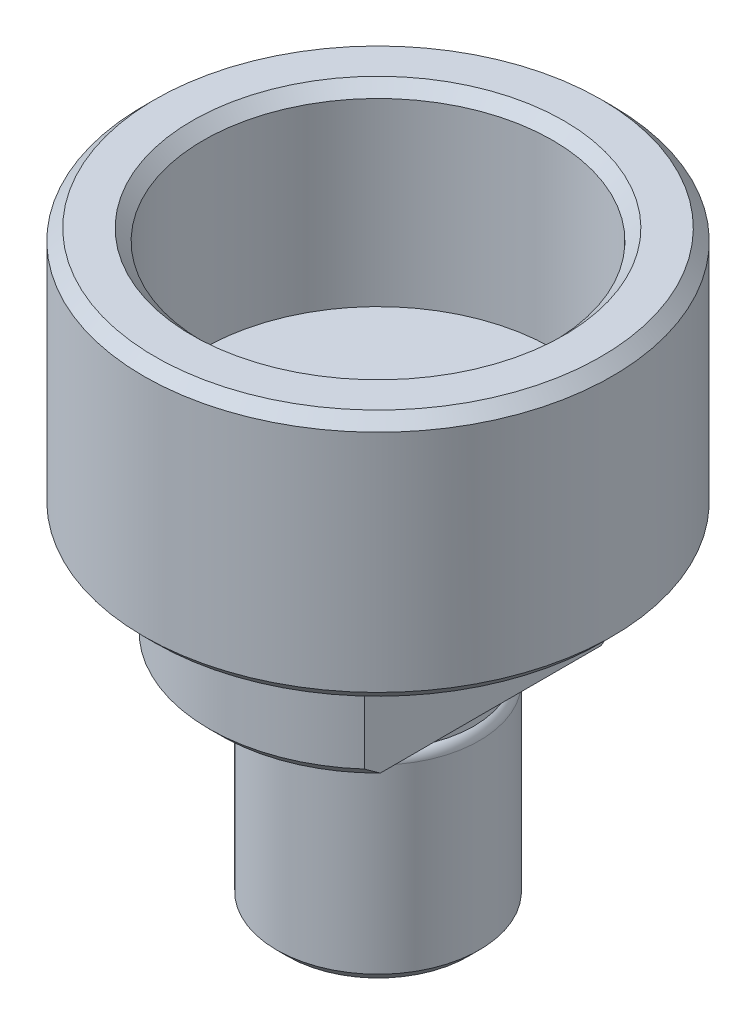
ISO-10303-21;
HEADER;
FILE_DESCRIPTION(('STEP AP214'),'2;1');
FILE_NAME('part.step','',(''),(''),'','','');
FILE_SCHEMA(('AUTOMOTIVE_DESIGN { 1 0 10303 214 1 1 1 1 }'));
ENDSEC;
DATA;
#1=APPLICATION_CONTEXT('core data for automotive mechanical design processes');
#2=APPLICATION_PROTOCOL_DEFINITION('international standard','automotive_design',2000,#1);
#3=PRODUCT_CONTEXT('',#1,'mechanical');
#4=PRODUCT('Part','Part','',(#3));
#5=PRODUCT_RELATED_PRODUCT_CATEGORY('part','',(#4));
#6=PRODUCT_DEFINITION_FORMATION('','',#4);
#7=PRODUCT_DEFINITION_CONTEXT('part definition',#1,'design');
#8=PRODUCT_DEFINITION('design','',#6,#7);
#9=PRODUCT_DEFINITION_SHAPE('','',#8);
#10=(LENGTH_UNIT() NAMED_UNIT(*) SI_UNIT(.MILLI.,.METRE.));
#11=(NAMED_UNIT(*) PLANE_ANGLE_UNIT() SI_UNIT($,.RADIAN.));
#12=(NAMED_UNIT(*) SI_UNIT($,.STERADIAN.) SOLID_ANGLE_UNIT());
#13=UNCERTAINTY_MEASURE_WITH_UNIT(LENGTH_MEASURE(1.E-05),#10,'distance_accuracy_value','');
#14=(GEOMETRIC_REPRESENTATION_CONTEXT(3) GLOBAL_UNCERTAINTY_ASSIGNED_CONTEXT((#13)) GLOBAL_UNIT_ASSIGNED_CONTEXT((#10,
#11,#12)) REPRESENTATION_CONTEXT('',''));
#15=CARTESIAN_POINT('',(0.,0.,0.));
#16=DIRECTION('',(0.,0.,1.));
#17=DIRECTION('',(1.,0.,0.));
#18=AXIS2_PLACEMENT_3D('',#15,#16,#17);
#19=CARTESIAN_POINT('',(0.,50.3749900838748,0.));
#20=DIRECTION('',(0.,1.,0.));
#21=DIRECTION('',(0.,0.,1.));
#22=AXIS2_PLACEMENT_3D('',#19,#20,#21);
#23=CYLINDRICAL_SURFACE('',#22,15.);
#24=CARTESIAN_POINT('',(0.,21.,0.));
#25=DIRECTION('',(0.,1.,0.));
#26=DIRECTION('',(0.,0.,1.));
#27=AXIS2_PLACEMENT_3D('',#24,#25,#26);
#28=CIRCLE('',#27,15.);
#29=CARTESIAN_POINT('',(10.,21.,-11.1803398874989));
#30=VERTEX_POINT('',#29);
#31=CARTESIAN_POINT('',(-10.,21.,-11.180339887499));
#32=VERTEX_POINT('',#31);
#33=EDGE_CURVE('E147',#30,#32,#28,.T.);
#34=ORIENTED_EDGE('',*,*,#33,.T.);
#35=DIRECTION('',(0.,-1.,0.));
#36=VECTOR('',#35,1.);
#37=CARTESIAN_POINT('',(-10.,56.8303043016158,-11.180339887499));
#38=LINE('',#37,#36);
#39=CARTESIAN_POINT('',(-10.,30.,-11.180339887499));
#40=VERTEX_POINT('',#39);
#41=EDGE_CURVE('E106',#40,#32,#38,.T.);
#42=ORIENTED_EDGE('',*,*,#41,.F.);
#43=CARTESIAN_POINT('',(0.,30.,0.));
#44=DIRECTION('',(0.,1.,0.));
#45=DIRECTION('',(0.,0.,1.));
#46=AXIS2_PLACEMENT_3D('',#43,#44,#45);
#47=CIRCLE('',#46,15.);
#48=CARTESIAN_POINT('',(10.,30.,-11.1803398874989));
#49=VERTEX_POINT('',#48);
#50=EDGE_CURVE('E105',#49,#40,#47,.T.);
#51=ORIENTED_EDGE('',*,*,#50,.F.);
#52=DIRECTION('',(0.,-1.,0.));
#53=VECTOR('',#52,1.);
#54=CARTESIAN_POINT('',(10.,56.8303043016158,-11.1803398874989));
#55=LINE('',#54,#53);
#56=EDGE_CURVE('E249',#49,#30,#55,.T.);
#57=ORIENTED_EDGE('',*,*,#56,.T.);
#58=EDGE_LOOP('',(#34,#42,#51,#57));
#59=FACE_BOUND('',#58,.T.);
#60=ADVANCED_FACE('F33',(#59),#23,.T.);
#61=CARTESIAN_POINT('',(0.,21.,0.));
#62=DIRECTION('',(0.,1.,0.));
#63=DIRECTION('',(0.,0.,1.));
#64=AXIS2_PLACEMENT_3D('',#61,#62,#63);
#65=CONICAL_SURFACE('',#64,15.,0.78539816339745);
#66=CARTESIAN_POINT('',(-10.,32.5644441736091,-24.6103574588586));
#67=CARTESIAN_POINT('',(-10.,32.2216905274031,-24.2403780110369));
#68=CARTESIAN_POINT('',(-10.,31.8795152361576,-23.8698614563677));
#69=CARTESIAN_POINT('',(-10.,31.196508334364,-23.1275872380002));
#70=CARTESIAN_POINT('',(-10.,30.8556767334816,-22.7558295654095));
#71=CARTESIAN_POINT('',(-10.,30.1754748234069,-22.0108301601288));
#72=CARTESIAN_POINT('',(-10.,29.8361048497004,-21.6375881209847));
#73=CARTESIAN_POINT('',(-10.,29.1591402559152,-20.8894981010583));
#74=CARTESIAN_POINT('',(-10.,28.8215456324339,-20.5146501233564));
#75=CARTESIAN_POINT('',(-10.,28.1464075059443,-19.7608611770608));
#76=CARTESIAN_POINT('',(-10.,27.8088763594913,-19.3819091350376));
#77=CARTESIAN_POINT('',(-10.,27.1362616375537,-18.621839069388));
#78=CARTESIAN_POINT('',(-10.,26.8011780566562,-18.2407210505552));
#79=CARTESIAN_POINT('',(-10.,26.1339423824658,-17.4759989187297));
#80=CARTESIAN_POINT('',(-10.,25.8017899728563,-17.0923950819376));
#81=CARTESIAN_POINT('',(-10.,25.1409431225824,-16.3222193994949));
#82=CARTESIAN_POINT('',(-10.,24.8122486659603,-15.9356475675552));
#83=CARTESIAN_POINT('',(-10.,24.2245317757005,-15.2368546277592));
#84=CARTESIAN_POINT('',(-10.,23.9647550380599,-14.9252682200788));
#85=CARTESIAN_POINT('',(-10.,23.4483413376404,-14.2995054302808));
#86=CARTESIAN_POINT('',(-10.,23.1917043502325,-13.985329068512));
#87=CARTESIAN_POINT('',(-10.,22.6820772637162,-13.3538933206977));
#88=CARTESIAN_POINT('',(-10.,22.4290881319471,-13.0366331529145));
#89=CARTESIAN_POINT('',(-10.,21.9275509493998,-12.3986197972893));
#90=CARTESIAN_POINT('',(-10.,21.6790028656167,-12.0778666354352));
#91=CARTESIAN_POINT('',(-10.,21.1875502500527,-11.4326438070171));
#92=CARTESIAN_POINT('',(-10.,20.9446395182488,-11.108178872598));
#93=CARTESIAN_POINT('',(-10.,20.4653334597884,-10.4544394881493));
#94=CARTESIAN_POINT('',(-10.,20.2289383898083,-10.1251648494271));
#95=CARTESIAN_POINT('',(-10.,19.7643059741728,-9.46109895998293));
#96=CARTESIAN_POINT('',(-10.,19.5360652053658,-9.12631011243504));
#97=CARTESIAN_POINT('',(-10.,19.0896742449105,-8.45009456194251));
#98=CARTESIAN_POINT('',(-10.,18.871522919324,-8.10866861108843));
#99=CARTESIAN_POINT('',(-10.,18.4541163076828,-7.42799976889248));
#100=CARTESIAN_POINT('',(-10.,18.2544960922178,-7.08898186795268));
#101=CARTESIAN_POINT('',(-10.,17.8704893467786,-6.40230874634735));
#102=CARTESIAN_POINT('',(-10.,17.6861045208227,-6.05465256516516));
#103=CARTESIAN_POINT('',(-10.,17.3369597792457,-5.34979787272712));
#104=CARTESIAN_POINT('',(-10.,17.1721879695829,-4.99260530726622));
#105=CARTESIAN_POINT('',(-10.,16.8676108195506,-4.26767172679641));
#106=CARTESIAN_POINT('',(-10.,16.727798461058,-3.89993371082866));
#107=CARTESIAN_POINT('',(-10.,16.50682763487,-3.23556268816039));
#108=CARTESIAN_POINT('',(-10.,16.4195291881363,-2.94098364490695));
#109=CARTESIAN_POINT('',(-10.,16.2674806467661,-2.34601701033665));
#110=CARTESIAN_POINT('',(-10.,16.2027277474496,-2.04563014642715));
#111=CARTESIAN_POINT('',(-10.,16.0989802914043,-1.44139591299687));
#112=CARTESIAN_POINT('',(-10.,16.0599015641133,-1.13756320711696));
#113=CARTESIAN_POINT('',(-10.,16.009297169542,-0.527590785366104));
#114=CARTESIAN_POINT('',(-10.,15.9977699006607,-0.221451204634574));
#115=CARTESIAN_POINT('',(-10.,16.0029524746225,0.391440262624027));
#116=CARTESIAN_POINT('',(-10.,16.0197412333657,0.698191472734164));
#117=CARTESIAN_POINT('',(-10.,16.0807204713956,1.30893601590609));
#118=CARTESIAN_POINT('',(-10.,16.1249131175112,1.61292912895606));
#119=CARTESIAN_POINT('',(-10.,16.2385095552279,2.21708187284227));
#120=CARTESIAN_POINT('',(-10.,16.3079917081605,2.51722655350808));
#121=CARTESIAN_POINT('',(-10.,16.4689760172869,3.11148447855054));
#122=CARTESIAN_POINT('',(-10.,16.5604791901926,3.40559744376187));
#123=CARTESIAN_POINT('',(-10.,16.7734548765495,4.01987818282988));
#124=CARTESIAN_POINT('',(-10.,16.8971364178112,4.33927357504705));
#125=CARTESIAN_POINT('',(-10.,17.1633649280956,4.97016892612008));
#126=CARTESIAN_POINT('',(-10.,17.3059198771215,5.28166547845749));
#127=CARTESIAN_POINT('',(-10.,17.6064808039564,5.89769520002045));
#128=CARTESIAN_POINT('',(-10.,17.7645119994124,6.2022159720844));
#129=CARTESIAN_POINT('',(-10.,18.0928538515898,6.80447097562444));
#130=CARTESIAN_POINT('',(-10.,18.263162952979,7.10220606042625));
#131=CARTESIAN_POINT('',(-10.,18.6159450346942,7.69542966012903));
#132=CARTESIAN_POINT('',(-10.,18.798543992619,7.9908429077063));
#133=CARTESIAN_POINT('',(-10.,19.1720554324511,8.5763546374259));
#134=CARTESIAN_POINT('',(-10.,19.3629681035662,8.86645299839561));
#135=CARTESIAN_POINT('',(-10.,19.7514253100881,9.44175091087438));
#136=CARTESIAN_POINT('',(-10.,19.9489632215143,9.72695494835962));
#137=CARTESIAN_POINT('',(-10.,20.3496766786508,10.2933602389833));
#138=CARTESIAN_POINT('',(-10.,20.5528521655921,10.5745615338023));
#139=CARTESIAN_POINT('',(-10.,20.9887612453635,11.1672748608417));
#140=CARTESIAN_POINT('',(-10.,21.2220989986398,11.4783418942238));
#141=CARTESIAN_POINT('',(-10.,21.6936712260345,12.096747683235));
#142=CARTESIAN_POINT('',(-10.,21.931905839655,12.404086332252));
#143=CARTESIAN_POINT('',(-10.,22.4124830849794,13.015581150023));
#144=CARTESIAN_POINT('',(-10.,22.6548261325384,13.3197369915134));
#145=CARTESIAN_POINT('',(-10.,23.1429613874972,13.9252706474696));
#146=CARTESIAN_POINT('',(-10.,23.3887536409655,14.2266484247415));
#147=CARTESIAN_POINT('',(-10.,24.1309416508131,15.1277078385904));
#148=CARTESIAN_POINT('',(-10.,24.6317229648929,15.7237777732566));
#149=CARTESIAN_POINT('',(-10.,25.6418999800074,16.9085714118714));
#150=CARTESIAN_POINT('',(-10.,26.1512959112258,17.4972949187898));
#151=CARTESIAN_POINT('',(-10.,26.9056587911493,18.3593115817367));
#152=CARTESIAN_POINT('',(-10.,27.1480720002065,18.6348451883551));
#153=CARTESIAN_POINT('',(-10.,27.6341954597043,19.1847583131501));
#154=CARTESIAN_POINT('',(-10.,27.8779056899267,19.4591378491978));
#155=CARTESIAN_POINT('',(-10.,28.6107786732563,20.2807468890151));
#156=CARTESIAN_POINT('',(-10.,29.1016718512256,20.8264332919545));
#157=CARTESIAN_POINT('',(-10.,30.0861834355478,21.9134039380248));
#158=CARTESIAN_POINT('',(-10.,30.5797946737353,22.4546946841883));
#159=CARTESIAN_POINT('',(-10.,31.5700218475962,23.5344790116023));
#160=CARTESIAN_POINT('',(-10.,32.0666376531121,24.0729727121686));
#161=CARTESIAN_POINT('',(-10.,32.5644441736091,24.6103574588586));
#162=B_SPLINE_CURVE_WITH_KNOTS('',3,(#66,#67,#68,#69,#70,#71,#72,#73,#74,#75,#76,#77,#78,#79,
#80,#81,#82,#83,#84,#85,#86,#87,#88,#89,#90,#91,#92,#93,#94,#95,#96,#97,#98,#99,#100,#101,#102,
#103,#104,#105,#106,#107,#108,#109,#110,#111,#112,#113,#114,#115,#116,#117,#118,#119,#120,#121,
#122,#123,#124,#125,#126,#127,#128,#129,#130,#131,#132,#133,#134,#135,#136,#137,#138,#139,#140,
#141,#142,#143,#144,#145,#146,#147,#148,#149,#150,#151,#152,#153,#154,#155,#156,#157,#158,#159,
#160,#161),.UNSPECIFIED.,.F.,.F.,(4,2,2,2,2,2,2,2,2,2,2,2,2,2,2,2,2,2,2,2,2,2,2,2,2,2,2,2,2,2,2,
2,2,2,2,2,2,2,2,2,2,2,2,2,2,2,2,4),(0.,1.51303871186474,3.02608828773642,4.53946839108167,
6.05284559291245,7.57526476841032,9.0976805760035,10.6199300324629,12.142172460924,
13.3591725240687,14.5761630345685,15.7934705419248,17.0107689987406,18.2266582841975,
19.4425953998349,20.6580159228905,21.8732995129504,23.0532599784362,24.2333522397084,
25.4127251644243,26.5917659477831,27.5127426411267,28.4336047234359,29.3514325707392,
30.2692070622632,31.1895435918779,32.1099529019026,33.0332387889305,33.9565673123118,
34.9833356839157,36.0105395857438,37.039446023785,38.0682223509588,39.1099287407537,
40.1516588506401,41.1923767800673,42.2330838645851,43.3995931312981,44.5661356757823,
45.7327970109922,46.8994739433089,49.2348850369403,51.5703586319431,52.6713304691807,
53.7722851941572,55.9742486399645,58.1719242629713,60.3695053551407),.UNSPECIFIED.);
#163=CARTESIAN_POINT('',(-10.,20.,-9.79795897113272));
#164=VERTEX_POINT('',#163);
#165=EDGE_CURVE('E11',#32,#164,#162,.T.);
#166=ORIENTED_EDGE('',*,*,#165,.F.);
#167=ORIENTED_EDGE('',*,*,#33,.F.);
#168=CARTESIAN_POINT('',(10.,32.5644441736091,24.6103574588586));
#169=CARTESIAN_POINT('',(10.,32.2216905274031,24.2403780110369));
#170=CARTESIAN_POINT('',(10.,31.8795152361576,23.8698614563677));
#171=CARTESIAN_POINT('',(10.,31.196508334364,23.1275872380002));
#172=CARTESIAN_POINT('',(10.,30.8556767334816,22.7558295654095));
#173=CARTESIAN_POINT('',(10.,30.1754748234069,22.0108301601288));
#174=CARTESIAN_POINT('',(10.,29.8361048497004,21.6375881209847));
#175=CARTESIAN_POINT('',(10.,29.1591402559152,20.8894981010583));
#176=CARTESIAN_POINT('',(10.,28.8215456324339,20.5146501233563));
#177=CARTESIAN_POINT('',(10.,28.1464075059443,19.7608611770608));
#178=CARTESIAN_POINT('',(10.,27.8088763594913,19.3819091350376));
#179=CARTESIAN_POINT('',(10.,27.1362616375537,18.621839069388));
#180=CARTESIAN_POINT('',(10.,26.8011780566562,18.2407210505552));
#181=CARTESIAN_POINT('',(10.,26.1339423824658,17.4759989187297));
#182=CARTESIAN_POINT('',(10.,25.8017899728563,17.0923950819376));
#183=CARTESIAN_POINT('',(10.,25.1409431225824,16.3222193994948));
#184=CARTESIAN_POINT('',(10.,24.8122486659603,15.9356475675552));
#185=CARTESIAN_POINT('',(10.,24.2245317757005,15.2368546277592));
#186=CARTESIAN_POINT('',(10.,23.9647550380599,14.9252682200788));
#187=CARTESIAN_POINT('',(10.,23.4483413376404,14.2995054302808));
#188=CARTESIAN_POINT('',(10.,23.1917043502325,13.985329068512));
#189=CARTESIAN_POINT('',(10.,22.6820772637162,13.3538933206977));
#190=CARTESIAN_POINT('',(10.,22.4290881319471,13.0366331529145));
#191=CARTESIAN_POINT('',(10.,21.9275509493998,12.3986197972893));
#192=CARTESIAN_POINT('',(10.,21.6790028656167,12.0778666354352));
#193=CARTESIAN_POINT('',(10.,21.1875502500527,11.432643807017));
#194=CARTESIAN_POINT('',(10.,20.9446395182488,11.108178872598));
#195=CARTESIAN_POINT('',(10.,20.4653334597884,10.4544394881493));
#196=CARTESIAN_POINT('',(10.,20.2289383898083,10.1251648494271));
#197=CARTESIAN_POINT('',(10.,19.7643059741728,9.46109895998293));
#198=CARTESIAN_POINT('',(10.,19.5360652053658,9.12631011243505));
#199=CARTESIAN_POINT('',(10.,19.0896742449105,8.45009456194252));
#200=CARTESIAN_POINT('',(10.,18.871522919324,8.10866861108844));
#201=CARTESIAN_POINT('',(10.,18.4541163076828,7.42799976889249));
#202=CARTESIAN_POINT('',(10.,18.2544960922178,7.08898186795269));
#203=CARTESIAN_POINT('',(10.,17.8704893467786,6.40230874634736));
#204=CARTESIAN_POINT('',(10.,17.6861045208227,6.05465256516517));
#205=CARTESIAN_POINT('',(10.,17.3369597792457,5.34979787272713));
#206=CARTESIAN_POINT('',(10.,17.1721879695829,4.99260530726623));
#207=CARTESIAN_POINT('',(10.,16.8676108195506,4.26767172679642));
#208=CARTESIAN_POINT('',(10.,16.727798461058,3.89993371082867));
#209=CARTESIAN_POINT('',(10.,16.50682763487,3.23556268816039));
#210=CARTESIAN_POINT('',(10.,16.4195291881363,2.94098364490695));
#211=CARTESIAN_POINT('',(10.,16.2674806467661,2.34601701033665));
#212=CARTESIAN_POINT('',(10.,16.2027277474496,2.04563014642715));
#213=CARTESIAN_POINT('',(10.,16.0989802914043,1.44139591299687));
#214=CARTESIAN_POINT('',(10.,16.0599015641133,1.13756320711696));
#215=CARTESIAN_POINT('',(10.,16.009297169542,0.527590785366105));
#216=CARTESIAN_POINT('',(10.,15.9977699006607,0.221451204634575));
#217=CARTESIAN_POINT('',(10.,16.0029524746225,-0.391440262624027));
#218=CARTESIAN_POINT('',(10.,16.0197412333657,-0.698191472734163));
#219=CARTESIAN_POINT('',(10.,16.0807204713956,-1.30893601590609));
#220=CARTESIAN_POINT('',(10.,16.1249131175112,-1.61292912895606));
#221=CARTESIAN_POINT('',(10.,16.2385095552279,-2.21708187284227));
#222=CARTESIAN_POINT('',(10.,16.3079917081605,-2.51722655350808));
#223=CARTESIAN_POINT('',(10.,16.4689760172869,-3.11148447855054));
#224=CARTESIAN_POINT('',(10.,16.5604791901926,-3.40559744376187));
#225=CARTESIAN_POINT('',(10.,16.7734548765495,-4.01987818282988));
#226=CARTESIAN_POINT('',(10.,16.8971364178112,-4.33927357504706));
#227=CARTESIAN_POINT('',(10.,17.1633649280956,-4.97016892612009));
#228=CARTESIAN_POINT('',(10.,17.3059198771215,-5.2816654784575));
#229=CARTESIAN_POINT('',(10.,17.6064808039564,-5.89769520002046));
#230=CARTESIAN_POINT('',(10.,17.7645119994124,-6.20221597208441));
#231=CARTESIAN_POINT('',(10.,18.0928538515899,-6.80447097562444));
#232=CARTESIAN_POINT('',(10.,18.263162952979,-7.10220606042626));
#233=CARTESIAN_POINT('',(10.,18.6159450346942,-7.69542966012904));
#234=CARTESIAN_POINT('',(10.,18.798543992619,-7.99084290770631));
#235=CARTESIAN_POINT('',(10.,19.1720554324511,-8.5763546374259));
#236=CARTESIAN_POINT('',(10.,19.3629681035662,-8.86645299839562));
#237=CARTESIAN_POINT('',(10.,19.7514253100881,-9.44175091087439));
#238=CARTESIAN_POINT('',(10.,19.9489632215143,-9.72695494835963));
#239=CARTESIAN_POINT('',(10.,20.3496766786508,-10.2933602389833));
#240=CARTESIAN_POINT('',(10.,20.5528521655921,-10.5745615338023));
#241=CARTESIAN_POINT('',(10.,20.9887612453635,-11.1672748608418));
#242=CARTESIAN_POINT('',(10.,21.2220989986399,-11.4783418942238));
#243=CARTESIAN_POINT('',(10.,21.6936712260346,-12.096747683235));
#244=CARTESIAN_POINT('',(10.,21.931905839655,-12.404086332252));
#245=CARTESIAN_POINT('',(10.,22.4124830849794,-13.015581150023));
#246=CARTESIAN_POINT('',(10.,22.6548261325384,-13.3197369915134));
#247=CARTESIAN_POINT('',(10.,23.1429613874972,-13.9252706474696));
#248=CARTESIAN_POINT('',(10.,23.3887536409655,-14.2266484247415));
#249=CARTESIAN_POINT('',(10.,24.1309416508131,-15.1277078385904));
#250=CARTESIAN_POINT('',(10.,24.6317229648929,-15.7237777732566));
#251=CARTESIAN_POINT('',(10.,25.6418999800074,-16.9085714118714));
#252=CARTESIAN_POINT('',(10.,26.1512959112258,-17.4972949187898));
#253=CARTESIAN_POINT('',(10.,26.9056587911493,-18.3593115817366));
#254=CARTESIAN_POINT('',(10.,27.1480720002065,-18.6348451883551));
#255=CARTESIAN_POINT('',(10.,27.6341954597043,-19.1847583131501));
#256=CARTESIAN_POINT('',(10.,27.8779056899267,-19.4591378491978));
#257=CARTESIAN_POINT('',(10.,28.6107786732563,-20.2807468890151));
#258=CARTESIAN_POINT('',(10.,29.1016718512256,-20.8264332919545));
#259=CARTESIAN_POINT('',(10.,30.0861834355478,-21.9134039380248));
#260=CARTESIAN_POINT('',(10.,30.5797946737353,-22.4546946841883));
#261=CARTESIAN_POINT('',(10.,31.5700218475961,-23.5344790116023));
#262=CARTESIAN_POINT('',(10.,32.0666376531121,-24.0729727121686));
#263=CARTESIAN_POINT('',(10.,32.5644441736091,-24.6103574588586));
#264=B_SPLINE_CURVE_WITH_KNOTS('',3,(#168,#169,#170,#171,#172,#173,#174,#175,#176,#177,#178,
#179,#180,#181,#182,#183,#184,#185,#186,#187,#188,#189,#190,#191,#192,#193,#194,#195,#196,#197,
#198,#199,#200,#201,#202,#203,#204,#205,#206,#207,#208,#209,#210,#211,#212,#213,#214,#215,#216,
#217,#218,#219,#220,#221,#222,#223,#224,#225,#226,#227,#228,#229,#230,#231,#232,#233,#234,#235,
#236,#237,#238,#239,#240,#241,#242,#243,#244,#245,#246,#247,#248,#249,#250,#251,#252,#253,#254,
#255,#256,#257,#258,#259,#260,#261,#262,#263),.UNSPECIFIED.,.F.,.F.,(4,2,2,2,2,2,2,2,2,2,2,2,2,
2,2,2,2,2,2,2,2,2,2,2,2,2,2,2,2,2,2,2,2,2,2,2,2,2,2,2,2,2,2,2,2,2,2,4),(0.,1.51303871186473,
3.02608828773642,4.53946839108167,6.05284559291245,7.57526476841031,9.0976805760035,
10.6199300324629,12.142172460924,13.3591725240687,14.5761630345685,15.7934705419248,
17.0107689987406,18.2266582841974,19.4425953998349,20.6580159228905,21.8732995129504,
23.0532599784362,24.2333522397084,25.4127251644243,26.5917659477831,27.5127426411267,
28.4336047234359,29.3514325707392,30.2692070622631,31.1895435918779,32.1099529019026,
33.0332387889305,33.9565673123118,34.9833356839156,36.0105395857438,37.039446023785,
38.0682223509588,39.1099287407536,40.1516588506401,41.1923767800673,42.2330838645851,
43.3995931312981,44.5661356757822,45.7327970109922,46.8994739433088,49.2348850369402,
51.5703586319431,52.6713304691806,53.7722851941571,55.9742486399644,58.1719242629713,
60.3695053551406),.UNSPECIFIED.);
#265=CARTESIAN_POINT('',(10.,20.,-9.79795897113272));
#266=VERTEX_POINT('',#265);
#267=EDGE_CURVE('E152',#266,#30,#264,.T.);
#268=ORIENTED_EDGE('',*,*,#267,.F.);
#269=CARTESIAN_POINT('',(0.,20.,0.));
#270=DIRECTION('',(0.,1.,0.));
#271=DIRECTION('',(0.,0.,1.));
#272=AXIS2_PLACEMENT_3D('',#269,#270,#271);
#273=CIRCLE('',#272,14.);
#274=EDGE_CURVE('E59',#164,#266,#273,.F.);
#275=ORIENTED_EDGE('',*,*,#274,.F.);
#276=EDGE_LOOP('',(#166,#167,#268,#275));
#277=FACE_BOUND('',#276,.T.);
#278=ADVANCED_FACE('F216',(#277),#65,.T.);
#279=CARTESIAN_POINT('',(0.,50.3749900838748,0.));
#280=DIRECTION('',(0.,1.,0.));
#281=DIRECTION('',(0.,0.,1.));
#282=AXIS2_PLACEMENT_3D('',#279,#280,#281);
#283=CYLINDRICAL_SURFACE('',#282,15.5);
#284=CARTESIAN_POINT('',(0.,51.,0.));
#285=DIRECTION('',(0.,-1.,0.));
#286=DIRECTION('',(0.,0.,-1.));
#287=AXIS2_PLACEMENT_3D('',#284,#285,#286);
#288=CIRCLE('',#287,15.5);
#289=CARTESIAN_POINT('',(0.,51.,-15.5));
#290=VERTEX_POINT('',#289);
#291=EDGE_CURVE('E128',#290,#290,#288,.F.);
#292=ORIENTED_EDGE('',*,*,#291,.T.);
#293=EDGE_LOOP('',(#292));
#294=FACE_BOUND('',#293,.T.);
#295=CARTESIAN_POINT('',(0.,35.,0.));
#296=DIRECTION('',(0.,1.,0.));
#297=DIRECTION('',(0.,0.,1.));
#298=AXIS2_PLACEMENT_3D('',#295,#296,#297);
#299=CIRCLE('',#298,15.5);
#300=CARTESIAN_POINT('',(0.,35.,15.5));
#301=VERTEX_POINT('',#300);
#302=EDGE_CURVE('E263',#301,#301,#299,.T.);
#303=ORIENTED_EDGE('',*,*,#302,.F.);
#304=EDGE_LOOP('',(#303));
#305=FACE_BOUND('',#304,.T.);
#306=ADVANCED_FACE('F212',(#294,#305),#283,.F.);
#307=CARTESIAN_POINT('',(15.5,52.,0.));
#308=DIRECTION('',(0.,-1.,0.));
#309=DIRECTION('',(0.,0.,-1.));
#310=AXIS2_PLACEMENT_3D('',#307,#308,#309);
#311=PLANE('',#310);
#312=CARTESIAN_POINT('',(0.,52.,0.));
#313=DIRECTION('',(0.,-1.,0.));
#314=DIRECTION('',(0.,0.,-1.));
#315=AXIS2_PLACEMENT_3D('',#312,#313,#314);
#316=CIRCLE('',#315,16.5);
#317=CARTESIAN_POINT('',(0.,52.,-16.5));
#318=VERTEX_POINT('',#317);
#319=EDGE_CURVE('E134',#318,#318,#316,.T.);
#320=ORIENTED_EDGE('',*,*,#319,.T.);
#321=EDGE_LOOP('',(#320));
#322=FACE_BOUND('',#321,.T.);
#323=CARTESIAN_POINT('',(0.,52.,0.));
#324=DIRECTION('',(0.,-1.,0.));
#325=DIRECTION('',(0.,0.,-1.));
#326=AXIS2_PLACEMENT_3D('',#323,#324,#325);
#327=CIRCLE('',#326,19.7902063121807);
#328=CARTESIAN_POINT('',(0.,52.,-19.7902063121807));
#329=VERTEX_POINT('',#328);
#330=EDGE_CURVE('E131',#329,#329,#327,.F.);
#331=ORIENTED_EDGE('',*,*,#330,.T.);
#332=EDGE_LOOP('',(#331));
#333=FACE_BOUND('',#332,.T.);
#334=ADVANCED_FACE('F208',(#322,#333),#311,.F.);
#335=CARTESIAN_POINT('',(0.,50.3749900838748,0.));
#336=DIRECTION('',(0.,1.,0.));
#337=DIRECTION('',(0.,0.,1.));
#338=AXIS2_PLACEMENT_3D('',#335,#336,#337);
#339=CYLINDRICAL_SURFACE('',#338,20.7902063121807);
#340=CARTESIAN_POINT('',(0.,51.,0.));
#341=DIRECTION('',(0.,-1.,0.));
#342=DIRECTION('',(0.,0.,-1.));
#343=AXIS2_PLACEMENT_3D('',#340,#341,#342);
#344=CIRCLE('',#343,20.7902063121807);
#345=CARTESIAN_POINT('',(0.,51.,-20.7902063121807));
#346=VERTEX_POINT('',#345);
#347=EDGE_CURVE('E140',#346,#346,#344,.T.);
#348=ORIENTED_EDGE('',*,*,#347,.T.);
#349=EDGE_LOOP('',(#348));
#350=FACE_BOUND('',#349,.T.);
#351=CARTESIAN_POINT('',(0.,31.,0.));
#352=DIRECTION('',(0.,1.,0.));
#353=DIRECTION('',(0.,0.,1.));
#354=AXIS2_PLACEMENT_3D('',#351,#352,#353);
#355=CIRCLE('',#354,20.7902063121807);
#356=CARTESIAN_POINT('',(0.,31.,20.7902063121807));
#357=VERTEX_POINT('',#356);
#358=EDGE_CURVE('E137',#357,#357,#355,.T.);
#359=ORIENTED_EDGE('',*,*,#358,.T.);
#360=EDGE_LOOP('',(#359));
#361=FACE_BOUND('',#360,.T.);
#362=ADVANCED_FACE('F204',(#350,#361),#339,.T.);
#363=CARTESIAN_POINT('',(20.7902063121808,30.,0.));
#364=DIRECTION('',(0.,1.,0.));
#365=DIRECTION('',(0.,0.,1.));
#366=AXIS2_PLACEMENT_3D('',#363,#364,#365);
#367=PLANE('',#366);
#368=CARTESIAN_POINT('',(0.,30.,0.));
#369=DIRECTION('',(0.,1.,0.));
#370=DIRECTION('',(0.,0.,1.));
#371=AXIS2_PLACEMENT_3D('',#368,#369,#370);
#372=CIRCLE('',#371,19.7902063121808);
#373=CARTESIAN_POINT('',(0.,30.,19.7902063121808));
#374=VERTEX_POINT('',#373);
#375=EDGE_CURVE('E143',#374,#374,#372,.F.);
#376=ORIENTED_EDGE('',*,*,#375,.T.);
#377=EDGE_LOOP('',(#376));
#378=FACE_BOUND('',#377,.T.);
#379=ORIENTED_EDGE('',*,*,#50,.T.);
#380=DIRECTION('',(0.,0.,1.));
#381=VECTOR('',#380,1.);
#382=CARTESIAN_POINT('',(-10.,30.,11.180339887499));
#383=LINE('',#382,#381);
#384=CARTESIAN_POINT('',(-10.,30.,11.180339887499));
#385=VERTEX_POINT('',#384);
#386=EDGE_CURVE('E92',#40,#385,#383,.T.);
#387=ORIENTED_EDGE('',*,*,#386,.T.);
#388=CARTESIAN_POINT('',(10.,30.,11.1803398874989));
#389=VERTEX_POINT('',#388);
#390=EDGE_CURVE('E102',#385,#389,#47,.T.);
#391=ORIENTED_EDGE('',*,*,#390,.T.);
#392=DIRECTION('',(0.,0.,-1.));
#393=VECTOR('',#392,1.);
#394=CARTESIAN_POINT('',(10.,30.,11.1803398874989));
#395=LINE('',#394,#393);
#396=EDGE_CURVE('E254',#389,#49,#395,.T.);
#397=ORIENTED_EDGE('',*,*,#396,.T.);
#398=EDGE_LOOP('',(#379,#387,#391,#397));
#399=FACE_BOUND('',#398,.T.);
#400=ADVANCED_FACE('F100',(#378,#399),#367,.F.);
#401=ORIENTED_EDGE('',*,*,#390,.F.);
#402=DIRECTION('',(0.,-1.,0.));
#403=VECTOR('',#402,1.);
#404=CARTESIAN_POINT('',(-10.,56.8303043016158,11.180339887499));
#405=LINE('',#404,#403);
#406=CARTESIAN_POINT('',(-10.,21.,11.180339887499));
#407=VERTEX_POINT('',#406);
#408=EDGE_CURVE('E89',#385,#407,#405,.T.);
#409=ORIENTED_EDGE('',*,*,#408,.T.);
#410=CARTESIAN_POINT('',(10.,21.,11.1803398874989));
#411=VERTEX_POINT('',#410);
#412=EDGE_CURVE('E146',#407,#411,#28,.T.);
#413=ORIENTED_EDGE('',*,*,#412,.T.);
#414=DIRECTION('',(0.,-1.,0.));
#415=VECTOR('',#414,1.);
#416=CARTESIAN_POINT('',(10.,56.8303043016158,11.1803398874989));
#417=LINE('',#416,#415);
#418=EDGE_CURVE('E111',#389,#411,#417,.T.);
#419=ORIENTED_EDGE('',*,*,#418,.F.);
#420=EDGE_LOOP('',(#401,#409,#413,#419));
#421=FACE_BOUND('',#420,.T.);
#422=ADVANCED_FACE('F109',(#421),#23,.T.);
#423=CARTESIAN_POINT('',(15.,20.,0.));
#424=DIRECTION('',(0.,1.,0.));
#425=DIRECTION('',(0.,0.,1.));
#426=AXIS2_PLACEMENT_3D('',#423,#424,#425);
#427=PLANE('',#426);
#428=CARTESIAN_POINT('',(10.,20.,9.79795897113272));
#429=VERTEX_POINT('',#428);
#430=CARTESIAN_POINT('',(-10.,20.,9.79795897113272));
#431=VERTEX_POINT('',#430);
#432=EDGE_CURVE('E150',#429,#431,#273,.F.);
#433=ORIENTED_EDGE('',*,*,#432,.T.);
#434=DIRECTION('',(0.,0.,-1.));
#435=VECTOR('',#434,1.);
#436=CARTESIAN_POINT('',(-10.,20.,0.));
#437=LINE('',#436,#435);
#438=EDGE_CURVE('E52',#431,#164,#437,.T.);
#439=ORIENTED_EDGE('',*,*,#438,.T.);
#440=ORIENTED_EDGE('',*,*,#274,.T.);
#441=DIRECTION('',(0.,0.,1.));
#442=VECTOR('',#441,1.);
#443=CARTESIAN_POINT('',(10.,20.,0.));
#444=LINE('',#443,#442);
#445=EDGE_CURVE('E261',#266,#429,#444,.T.);
#446=ORIENTED_EDGE('',*,*,#445,.T.);
#447=EDGE_LOOP('',(#433,#439,#440,#446));
#448=FACE_BOUND('',#447,.T.);
#449=CARTESIAN_POINT('',(0.,20.,0.));
#450=DIRECTION('',(0.,1.,0.));
#451=DIRECTION('',(0.,0.,1.));
#452=AXIS2_PLACEMENT_3D('',#449,#450,#451);
#453=CIRCLE('',#452,8.5);
#454=CARTESIAN_POINT('',(0.,20.,8.5));
#455=VERTEX_POINT('',#454);
#456=EDGE_CURVE('E112',#455,#455,#453,.T.);
#457=ORIENTED_EDGE('',*,*,#456,.T.);
#458=EDGE_LOOP('',(#457));
#459=FACE_BOUND('',#458,.T.);
#460=ADVANCED_FACE('F196',(#448,#459),#427,.F.);
#461=CARTESIAN_POINT('',(0.,50.3749900838748,0.));
#462=DIRECTION('',(0.,1.,0.));
#463=DIRECTION('',(0.,0.,1.));
#464=AXIS2_PLACEMENT_3D('',#461,#462,#463);
#465=CYLINDRICAL_SURFACE('',#464,8.5);
#466=ORIENTED_EDGE('',*,*,#456,.F.);
#467=EDGE_LOOP('',(#466));
#468=FACE_BOUND('',#467,.T.);
#469=CARTESIAN_POINT('',(0.,17.9516889657543,0.));
#470=DIRECTION('',(0.,1.,0.));
#471=DIRECTION('',(0.,0.,1.));
#472=AXIS2_PLACEMENT_3D('',#469,#470,#471);
#473=CIRCLE('',#472,8.5);
#474=CARTESIAN_POINT('',(0.,17.9516889657543,8.5));
#475=VERTEX_POINT('',#474);
#476=EDGE_CURVE('E116',#475,#475,#473,.T.);
#477=ORIENTED_EDGE('',*,*,#476,.T.);
#478=EDGE_LOOP('',(#477));
#479=FACE_BOUND('',#478,.T.);
#480=ADVANCED_FACE('F192',(#468,#479),#465,.T.);
#481=CARTESIAN_POINT('',(0.,50.3749900838748,0.));
#482=DIRECTION('',(0.,1.,0.));
#483=DIRECTION('',(0.,0.,1.));
#484=AXIS2_PLACEMENT_3D('',#481,#482,#483);
#485=CYLINDRICAL_SURFACE('',#484,9.00000000000001);
#486=CARTESIAN_POINT('',(0.,17.0856635619699,0.));
#487=DIRECTION('',(0.,1.,0.));
#488=DIRECTION('',(0.,0.,1.));
#489=AXIS2_PLACEMENT_3D('',#486,#487,#488);
#490=CIRCLE('',#489,9.00000000000001);
#491=CARTESIAN_POINT('',(0.,17.0856635619699,9.00000000000001));
#492=VERTEX_POINT('',#491);
#493=EDGE_CURVE('E125',#492,#492,#490,.F.);
#494=ORIENTED_EDGE('',*,*,#493,.T.);
#495=EDGE_LOOP('',(#494));
#496=FACE_BOUND('',#495,.T.);
#497=CARTESIAN_POINT('',(0.,1.00000000000001,0.));
#498=DIRECTION('',(0.,1.,0.));
#499=DIRECTION('',(0.,0.,1.));
#500=AXIS2_PLACEMENT_3D('',#497,#498,#499);
#501=CIRCLE('',#500,9.00000000000001);
#502=CARTESIAN_POINT('',(0.,1.00000000000001,9.00000000000001));
#503=VERTEX_POINT('',#502);
#504=EDGE_CURVE('E114',#503,#503,#501,.T.);
#505=ORIENTED_EDGE('',*,*,#504,.T.);
#506=EDGE_LOOP('',(#505));
#507=FACE_BOUND('',#506,.T.);
#508=ADVANCED_FACE('F188',(#496,#507),#485,.T.);
#509=CARTESIAN_POINT('',(9.00000000000001,0.,0.));
#510=DIRECTION('',(0.,1.,0.));
#511=DIRECTION('',(0.,0.,1.));
#512=AXIS2_PLACEMENT_3D('',#509,#510,#511);
#513=PLANE('',#512);
#514=CARTESIAN_POINT('',(0.,0.,0.));
#515=DIRECTION('',(0.,1.,0.));
#516=DIRECTION('',(0.,0.,1.));
#517=AXIS2_PLACEMENT_3D('',#514,#515,#516);
#518=CIRCLE('',#517,8.);
#519=CARTESIAN_POINT('',(0.,0.,8.));
#520=VERTEX_POINT('',#519);
#521=EDGE_CURVE('E122',#520,#520,#518,.F.);
#522=ORIENTED_EDGE('',*,*,#521,.T.);
#523=EDGE_LOOP('',(#522));
#524=FACE_BOUND('',#523,.T.);
#525=CARTESIAN_POINT('',(0.,0.,0.));
#526=DIRECTION('',(0.,1.,0.));
#527=DIRECTION('',(0.,0.,1.));
#528=AXIS2_PLACEMENT_3D('',#525,#526,#527);
#529=CIRCLE('',#528,4.76250000000001);
#530=CARTESIAN_POINT('',(0.,0.,4.76250000000001));
#531=VERTEX_POINT('',#530);
#532=EDGE_CURVE('E278',#531,#531,#529,.T.);
#533=ORIENTED_EDGE('',*,*,#532,.T.);
#534=EDGE_LOOP('',(#533));
#535=FACE_BOUND('',#534,.T.);
#536=ADVANCED_FACE('F184',(#524,#535),#513,.F.);
#537=CARTESIAN_POINT('',(0.,50.3749900838748,0.));
#538=DIRECTION('',(0.,1.,0.));
#539=DIRECTION('',(0.,0.,1.));
#540=AXIS2_PLACEMENT_3D('',#537,#538,#539);
#541=CYLINDRICAL_SURFACE('',#540,4.7625);
#542=ORIENTED_EDGE('',*,*,#532,.F.);
#543=EDGE_LOOP('',(#542));
#544=FACE_BOUND('',#543,.T.);
#545=CARTESIAN_POINT('',(0.,30.,0.));
#546=DIRECTION('',(0.,1.,0.));
#547=DIRECTION('',(0.,0.,1.));
#548=AXIS2_PLACEMENT_3D('',#545,#546,#547);
#549=CIRCLE('',#548,4.7625);
#550=CARTESIAN_POINT('',(0.,30.,4.7625));
#551=VERTEX_POINT('',#550);
#552=EDGE_CURVE('E275',#551,#551,#549,.T.);
#553=ORIENTED_EDGE('',*,*,#552,.T.);
#554=EDGE_LOOP('',(#553));
#555=FACE_BOUND('',#554,.T.);
#556=ADVANCED_FACE('F180',(#544,#555),#541,.F.);
#557=CARTESIAN_POINT('',(4.7625,30.,0.));
#558=DIRECTION('',(0.,1.,0.));
#559=DIRECTION('',(0.,0.,1.));
#560=AXIS2_PLACEMENT_3D('',#557,#558,#559);
#561=PLANE('',#560);
#562=ORIENTED_EDGE('',*,*,#552,.F.);
#563=EDGE_LOOP('',(#562));
#564=FACE_BOUND('',#563,.T.);
#565=CARTESIAN_POINT('',(0.,30.,0.));
#566=DIRECTION('',(0.,1.,0.));
#567=DIRECTION('',(0.,0.,1.));
#568=AXIS2_PLACEMENT_3D('',#565,#566,#567);
#569=CIRCLE('',#568,4.2625);
#570=CARTESIAN_POINT('',(0.,30.,4.2625));
#571=VERTEX_POINT('',#570);
#572=EDGE_CURVE('E272',#571,#571,#569,.T.);
#573=ORIENTED_EDGE('',*,*,#572,.T.);
#574=EDGE_LOOP('',(#573));
#575=FACE_BOUND('',#574,.T.);
#576=ADVANCED_FACE('F176',(#564,#575),#561,.F.);
#577=CARTESIAN_POINT('',(0.,50.3749900838748,0.));
#578=DIRECTION('',(0.,1.,0.));
#579=DIRECTION('',(0.,0.,1.));
#580=AXIS2_PLACEMENT_3D('',#577,#578,#579);
#581=CYLINDRICAL_SURFACE('',#580,4.2625);
#582=ORIENTED_EDGE('',*,*,#572,.F.);
#583=EDGE_LOOP('',(#582));
#584=FACE_BOUND('',#583,.T.);
#585=CARTESIAN_POINT('',(0.,34.,0.));
#586=DIRECTION('',(0.,1.,0.));
#587=DIRECTION('',(0.,0.,1.));
#588=AXIS2_PLACEMENT_3D('',#585,#586,#587);
#589=CIRCLE('',#588,4.2625);
#590=CARTESIAN_POINT('',(0.,34.,4.2625));
#591=VERTEX_POINT('',#590);
#592=EDGE_CURVE('E269',#591,#591,#589,.T.);
#593=ORIENTED_EDGE('',*,*,#592,.T.);
#594=EDGE_LOOP('',(#593));
#595=FACE_BOUND('',#594,.T.);
#596=ADVANCED_FACE('F172',(#584,#595),#581,.F.);
#597=CARTESIAN_POINT('',(0.,35.,0.));
#598=DIRECTION('',(0.,1.,0.));
#599=DIRECTION('',(0.,0.,1.));
#600=AXIS2_PLACEMENT_3D('',#597,#598,#599);
#601=CONICAL_SURFACE('',#600,5.2625,0.785398163397448);
#602=ORIENTED_EDGE('',*,*,#592,.F.);
#603=EDGE_LOOP('',(#602));
#604=FACE_BOUND('',#603,.T.);
#605=CARTESIAN_POINT('',(0.,35.,0.));
#606=DIRECTION('',(0.,1.,0.));
#607=DIRECTION('',(0.,0.,1.));
#608=AXIS2_PLACEMENT_3D('',#605,#606,#607);
#609=CIRCLE('',#608,5.2625);
#610=CARTESIAN_POINT('',(0.,35.,5.2625));
#611=VERTEX_POINT('',#610);
#612=EDGE_CURVE('E266',#611,#611,#609,.T.);
#613=ORIENTED_EDGE('',*,*,#612,.T.);
#614=EDGE_LOOP('',(#613));
#615=FACE_BOUND('',#614,.T.);
#616=ADVANCED_FACE('F168',(#604,#615),#601,.F.);
#617=CARTESIAN_POINT('',(5.2625,35.,0.));
#618=DIRECTION('',(0.,-1.,0.));
#619=DIRECTION('',(0.,0.,-1.));
#620=AXIS2_PLACEMENT_3D('',#617,#618,#619);
#621=PLANE('',#620);
#622=ORIENTED_EDGE('',*,*,#612,.F.);
#623=EDGE_LOOP('',(#622));
#624=FACE_BOUND('',#623,.T.);
#625=ORIENTED_EDGE('',*,*,#302,.T.);
#626=EDGE_LOOP('',(#625));
#627=FACE_BOUND('',#626,.T.);
#628=ADVANCED_FACE('F164',(#624,#627),#621,.F.);
#629=CARTESIAN_POINT('',(0.,1.00000000000001,0.));
#630=DIRECTION('',(0.,1.,0.));
#631=DIRECTION('',(0.,0.,1.));
#632=AXIS2_PLACEMENT_3D('',#629,#630,#631);
#633=CONICAL_SURFACE('',#632,9.00000000000001,0.785398163397447);
#634=ORIENTED_EDGE('',*,*,#521,.F.);
#635=EDGE_LOOP('',(#634));
#636=FACE_BOUND('',#635,.T.);
#637=ORIENTED_EDGE('',*,*,#504,.F.);
#638=EDGE_LOOP('',(#637));
#639=FACE_BOUND('',#638,.T.);
#640=ADVANCED_FACE('F167',(#636,#639),#633,.T.);
#641=CARTESIAN_POINT('',(0.,17.0856635619699,0.));
#642=DIRECTION('',(0.,1.,0.));
#643=DIRECTION('',(0.,0.,1.));
#644=AXIS2_PLACEMENT_3D('',#641,#642,#643);
#645=TOROIDAL_SURFACE('',#644,8.,1.);
#646=ORIENTED_EDGE('',*,*,#493,.F.);
#647=EDGE_LOOP('',(#646));
#648=FACE_BOUND('',#647,.T.);
#649=ORIENTED_EDGE('',*,*,#476,.F.);
#650=EDGE_LOOP('',(#649));
#651=FACE_BOUND('',#650,.T.);
#652=ADVANCED_FACE('F220',(#648,#651),#645,.T.);
#653=CARTESIAN_POINT('',(0.,51.,0.));
#654=DIRECTION('',(0.,1.,0.));
#655=DIRECTION('',(0.,0.,1.));
#656=AXIS2_PLACEMENT_3D('',#653,#654,#655);
#657=CONICAL_SURFACE('',#656,15.5,0.785398163397455);
#658=ORIENTED_EDGE('',*,*,#319,.F.);
#659=EDGE_LOOP('',(#658));
#660=FACE_BOUND('',#659,.T.);
#661=ORIENTED_EDGE('',*,*,#291,.F.);
#662=EDGE_LOOP('',(#661));
#663=FACE_BOUND('',#662,.T.);
#664=ADVANCED_FACE('F224',(#660,#663),#657,.F.);
#665=CARTESIAN_POINT('',(0.,52.,0.));
#666=DIRECTION('',(0.,-1.,0.));
#667=DIRECTION('',(0.,0.,-1.));
#668=AXIS2_PLACEMENT_3D('',#665,#666,#667);
#669=CONICAL_SURFACE('',#668,19.7902063121807,0.785398163397445);
#670=ORIENTED_EDGE('',*,*,#347,.F.);
#671=EDGE_LOOP('',(#670));
#672=FACE_BOUND('',#671,.T.);
#673=ORIENTED_EDGE('',*,*,#330,.F.);
#674=EDGE_LOOP('',(#673));
#675=FACE_BOUND('',#674,.T.);
#676=ADVANCED_FACE('F228',(#672,#675),#669,.T.);
#677=CARTESIAN_POINT('',(0.,31.,0.));
#678=DIRECTION('',(0.,1.,0.));
#679=DIRECTION('',(0.,0.,1.));
#680=AXIS2_PLACEMENT_3D('',#677,#678,#679);
#681=CONICAL_SURFACE('',#680,20.7902063121807,0.78539816339745);
#682=ORIENTED_EDGE('',*,*,#375,.F.);
#683=EDGE_LOOP('',(#682));
#684=FACE_BOUND('',#683,.T.);
#685=ORIENTED_EDGE('',*,*,#358,.F.);
#686=EDGE_LOOP('',(#685));
#687=FACE_BOUND('',#686,.T.);
#688=ADVANCED_FACE('F231',(#684,#687),#681,.T.);
#689=EDGE_CURVE('E38',#431,#407,#162,.T.);
#690=ORIENTED_EDGE('',*,*,#689,.F.);
#691=ORIENTED_EDGE('',*,*,#432,.F.);
#692=EDGE_CURVE('E157',#411,#429,#264,.T.);
#693=ORIENTED_EDGE('',*,*,#692,.F.);
#694=ORIENTED_EDGE('',*,*,#412,.F.);
#695=EDGE_LOOP('',(#690,#691,#693,#694));
#696=FACE_BOUND('',#695,.T.);
#697=ADVANCED_FACE('F35',(#696),#65,.T.);
#698=CARTESIAN_POINT('',(10.,56.8303043016158,11.1803398874989));
#699=DIRECTION('',(-1.,0.,0.));
#700=DIRECTION('',(0.,0.,1.));
#701=AXIS2_PLACEMENT_3D('',#698,#699,#700);
#702=PLANE('',#701);
#703=ORIENTED_EDGE('',*,*,#692,.T.);
#704=ORIENTED_EDGE('',*,*,#445,.F.);
#705=ORIENTED_EDGE('',*,*,#267,.T.);
#706=ORIENTED_EDGE('',*,*,#56,.F.);
#707=ORIENTED_EDGE('',*,*,#396,.F.);
#708=ORIENTED_EDGE('',*,*,#418,.T.);
#709=EDGE_LOOP('',(#703,#704,#705,#706,#707,#708));
#710=FACE_BOUND('',#709,.T.);
#711=ADVANCED_FACE('F158',(#710),#702,.F.);
#712=CARTESIAN_POINT('',(-10.,56.8303043016158,11.180339887499));
#713=DIRECTION('',(1.,0.,0.));
#714=DIRECTION('',(0.,0.,-1.));
#715=AXIS2_PLACEMENT_3D('',#712,#713,#714);
#716=PLANE('',#715);
#717=ORIENTED_EDGE('',*,*,#165,.T.);
#718=ORIENTED_EDGE('',*,*,#438,.F.);
#719=ORIENTED_EDGE('',*,*,#689,.T.);
#720=ORIENTED_EDGE('',*,*,#408,.F.);
#721=ORIENTED_EDGE('',*,*,#386,.F.);
#722=ORIENTED_EDGE('',*,*,#41,.T.);
#723=EDGE_LOOP('',(#717,#718,#719,#720,#721,#722));
#724=FACE_BOUND('',#723,.T.);
#725=ADVANCED_FACE('F91',(#724),#716,.F.);
#726=CLOSED_SHELL('',(#60,#278,#306,#334,#362,#400,#422,#460,#480,#508,#536,#556,#576,#596,#616,
#628,#640,#652,#664,#676,#688,#697,#711,#725));
#727=MANIFOLD_SOLID_BREP('B2',#726);
#728=ADVANCED_BREP_SHAPE_REPRESENTATION('',(#18,#727),#14);
#729=SHAPE_DEFINITION_REPRESENTATION(#9,#728);
ENDSEC;
END-ISO-10303-21;
